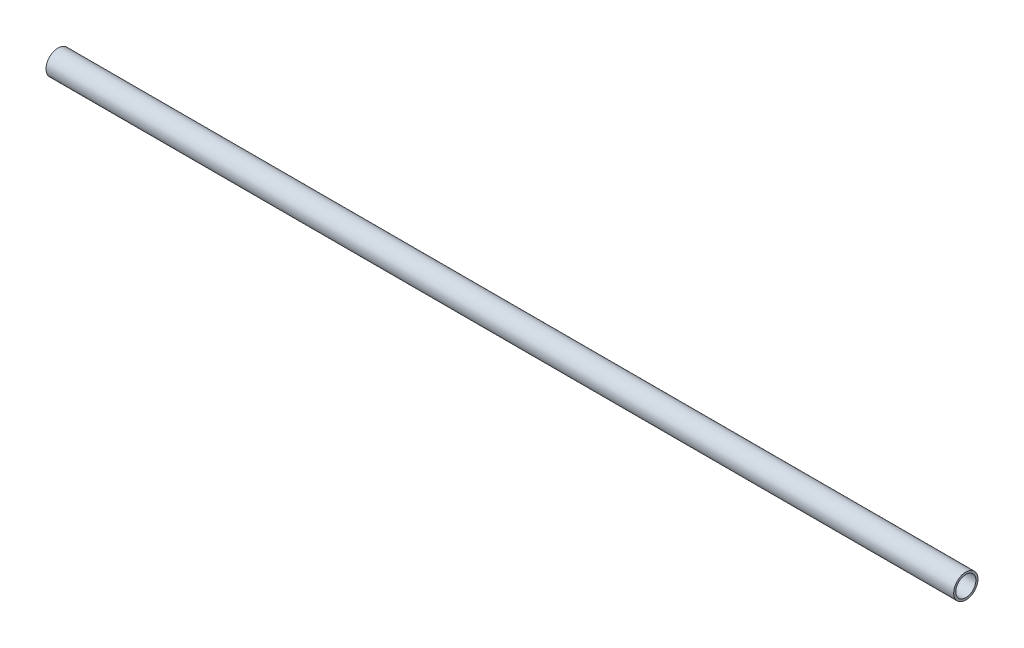
ISO-10303-21;
HEADER;
FILE_DESCRIPTION(('STEP AP214'),'2;1');
FILE_NAME('part.step','',(''),(''),'','','');
FILE_SCHEMA(('AUTOMOTIVE_DESIGN { 1 0 10303 214 1 1 1 1 }'));
ENDSEC;
DATA;
#1=APPLICATION_CONTEXT('core data for automotive mechanical design processes');
#2=APPLICATION_PROTOCOL_DEFINITION('international standard','automotive_design',2000,#1);
#3=PRODUCT_CONTEXT('',#1,'mechanical');
#4=PRODUCT('Part','Part','',(#3));
#5=PRODUCT_RELATED_PRODUCT_CATEGORY('part','',(#4));
#6=PRODUCT_DEFINITION_FORMATION('','',#4);
#7=PRODUCT_DEFINITION_CONTEXT('part definition',#1,'design');
#8=PRODUCT_DEFINITION('design','',#6,#7);
#9=PRODUCT_DEFINITION_SHAPE('','',#8);
#10=(LENGTH_UNIT() NAMED_UNIT(*) SI_UNIT(.MILLI.,.METRE.));
#11=(NAMED_UNIT(*) PLANE_ANGLE_UNIT() SI_UNIT($,.RADIAN.));
#12=(NAMED_UNIT(*) SI_UNIT($,.STERADIAN.) SOLID_ANGLE_UNIT());
#13=UNCERTAINTY_MEASURE_WITH_UNIT(LENGTH_MEASURE(1.E-05),#10,'distance_accuracy_value','');
#14=(GEOMETRIC_REPRESENTATION_CONTEXT(3) GLOBAL_UNCERTAINTY_ASSIGNED_CONTEXT((#13)) GLOBAL_UNIT_ASSIGNED_CONTEXT((#10,
#11,#12)) REPRESENTATION_CONTEXT('',''));
#15=CARTESIAN_POINT('',(0.,0.,0.));
#16=DIRECTION('',(0.,0.,1.));
#17=DIRECTION('',(1.,0.,0.));
#18=AXIS2_PLACEMENT_3D('',#15,#16,#17);
#19=CARTESIAN_POINT('',(355.6,0.,0.));
#20=DIRECTION('',(1.,0.,0.));
#21=DIRECTION('',(0.,0.,-1.));
#22=AXIS2_PLACEMENT_3D('',#19,#20,#21);
#23=PLANE('',#22);
#24=CARTESIAN_POINT('',(355.6,0.,0.));
#25=DIRECTION('',(1.,0.,0.));
#26=DIRECTION('',(0.,0.,-1.));
#27=AXIS2_PLACEMENT_3D('',#24,#25,#26);
#28=CIRCLE('',#27,9.525);
#29=CARTESIAN_POINT('',(355.6,0.,-9.525));
#30=VERTEX_POINT('',#29);
#31=EDGE_CURVE('E10',#30,#30,#28,.T.);
#32=ORIENTED_EDGE('',*,*,#31,.T.);
#33=EDGE_LOOP('',(#32));
#34=FACE_BOUND('',#33,.T.);
#35=CARTESIAN_POINT('',(355.6,0.,0.));
#36=DIRECTION('',(1.,0.,0.));
#37=DIRECTION('',(0.,0.,-1.));
#38=AXIS2_PLACEMENT_3D('',#35,#36,#37);
#39=CIRCLE('',#38,7.874);
#40=CARTESIAN_POINT('',(355.6,0.,-7.874));
#41=VERTEX_POINT('',#40);
#42=EDGE_CURVE('E44',#41,#41,#39,.T.);
#43=ORIENTED_EDGE('',*,*,#42,.F.);
#44=EDGE_LOOP('',(#43));
#45=FACE_BOUND('',#44,.T.);
#46=ADVANCED_FACE('F33',(#34,#45),#23,.T.);
#47=CARTESIAN_POINT('',(-355.6,0.,0.));
#48=DIRECTION('',(1.,0.,0.));
#49=DIRECTION('',(0.,0.,-1.));
#50=AXIS2_PLACEMENT_3D('',#47,#48,#49);
#51=PLANE('',#50);
#52=CARTESIAN_POINT('',(-355.6,0.,0.));
#53=DIRECTION('',(1.,0.,0.));
#54=DIRECTION('',(0.,0.,-1.));
#55=AXIS2_PLACEMENT_3D('',#52,#53,#54);
#56=CIRCLE('',#55,9.525);
#57=CARTESIAN_POINT('',(-355.6,0.,-9.525));
#58=VERTEX_POINT('',#57);
#59=EDGE_CURVE('E37',#58,#58,#56,.T.);
#60=ORIENTED_EDGE('',*,*,#59,.F.);
#61=EDGE_LOOP('',(#60));
#62=FACE_BOUND('',#61,.T.);
#63=CARTESIAN_POINT('',(-355.6,0.,0.));
#64=DIRECTION('',(1.,0.,0.));
#65=DIRECTION('',(0.,0.,-1.));
#66=AXIS2_PLACEMENT_3D('',#63,#64,#65);
#67=CIRCLE('',#66,7.874);
#68=CARTESIAN_POINT('',(-355.6,0.,-7.874));
#69=VERTEX_POINT('',#68);
#70=EDGE_CURVE('E46',#69,#69,#67,.T.);
#71=ORIENTED_EDGE('',*,*,#70,.T.);
#72=EDGE_LOOP('',(#71));
#73=FACE_BOUND('',#72,.T.);
#74=ADVANCED_FACE('F56',(#62,#73),#51,.F.);
#75=CARTESIAN_POINT('',(355.6,0.,0.));
#76=DIRECTION('',(-1.,0.,0.));
#77=DIRECTION('',(0.,0.,1.));
#78=AXIS2_PLACEMENT_3D('',#75,#76,#77);
#79=CYLINDRICAL_SURFACE('',#78,9.525);
#80=ORIENTED_EDGE('',*,*,#31,.F.);
#81=EDGE_LOOP('',(#80));
#82=FACE_BOUND('',#81,.T.);
#83=ORIENTED_EDGE('',*,*,#59,.T.);
#84=EDGE_LOOP('',(#83));
#85=FACE_BOUND('',#84,.T.);
#86=ADVANCED_FACE('F35',(#82,#85),#79,.T.);
#87=CARTESIAN_POINT('',(355.6,0.,0.));
#88=DIRECTION('',(-1.,0.,0.));
#89=DIRECTION('',(0.,0.,1.));
#90=AXIS2_PLACEMENT_3D('',#87,#88,#89);
#91=CYLINDRICAL_SURFACE('',#90,7.874);
#92=ORIENTED_EDGE('',*,*,#42,.T.);
#93=EDGE_LOOP('',(#92));
#94=FACE_BOUND('',#93,.T.);
#95=ORIENTED_EDGE('',*,*,#70,.F.);
#96=EDGE_LOOP('',(#95));
#97=FACE_BOUND('',#96,.T.);
#98=ADVANCED_FACE('F52',(#94,#97),#91,.F.);
#99=CLOSED_SHELL('',(#46,#74,#86,#98));
#100=MANIFOLD_SOLID_BREP('B2',#99);
#101=ADVANCED_BREP_SHAPE_REPRESENTATION('',(#18,#100),#14);
#102=SHAPE_DEFINITION_REPRESENTATION(#9,#101);
ENDSEC;
END-ISO-10303-21;
